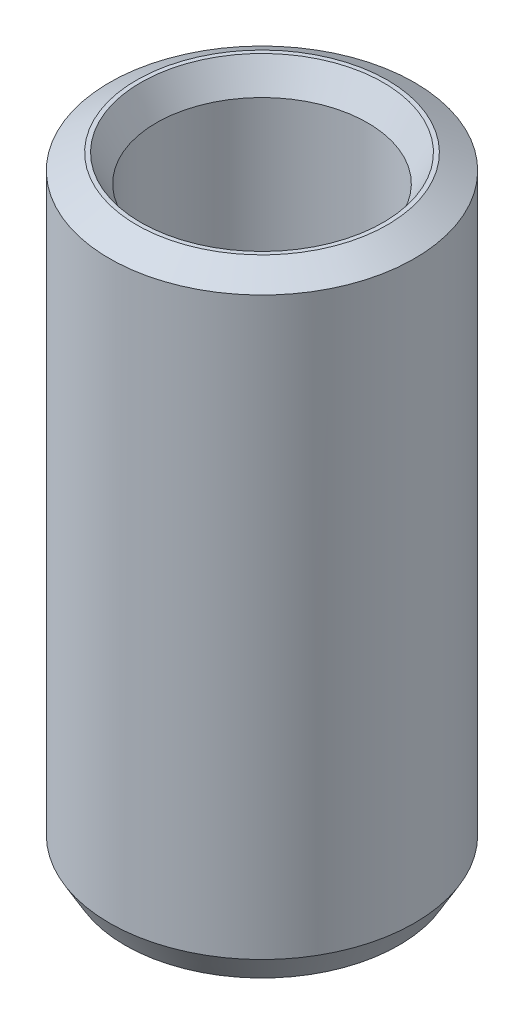
ISO-10303-21;
HEADER;
FILE_DESCRIPTION(('STEP AP214'),'2;1');
FILE_NAME('part.step','',(''),(''),'','','');
FILE_SCHEMA(('AUTOMOTIVE_DESIGN { 1 0 10303 214 1 1 1 1 }'));
ENDSEC;
DATA;
#1=APPLICATION_CONTEXT('core data for automotive mechanical design processes');
#2=APPLICATION_PROTOCOL_DEFINITION('international standard','automotive_design',2000,#1);
#3=PRODUCT_CONTEXT('',#1,'mechanical');
#4=PRODUCT('Part','Part','',(#3));
#5=PRODUCT_RELATED_PRODUCT_CATEGORY('part','',(#4));
#6=PRODUCT_DEFINITION_FORMATION('','',#4);
#7=PRODUCT_DEFINITION_CONTEXT('part definition',#1,'design');
#8=PRODUCT_DEFINITION('design','',#6,#7);
#9=PRODUCT_DEFINITION_SHAPE('','',#8);
#10=(LENGTH_UNIT() NAMED_UNIT(*) SI_UNIT(.MILLI.,.METRE.));
#11=(NAMED_UNIT(*) PLANE_ANGLE_UNIT() SI_UNIT($,.RADIAN.));
#12=(NAMED_UNIT(*) SI_UNIT($,.STERADIAN.) SOLID_ANGLE_UNIT());
#13=UNCERTAINTY_MEASURE_WITH_UNIT(LENGTH_MEASURE(1.E-05),#10,'distance_accuracy_value','');
#14=(GEOMETRIC_REPRESENTATION_CONTEXT(3) GLOBAL_UNCERTAINTY_ASSIGNED_CONTEXT((#13)) GLOBAL_UNIT_ASSIGNED_CONTEXT((#10,
#11,#12)) REPRESENTATION_CONTEXT('',''));
#15=CARTESIAN_POINT('',(0.,0.,0.));
#16=DIRECTION('',(0.,0.,1.));
#17=DIRECTION('',(1.,0.,0.));
#18=AXIS2_PLACEMENT_3D('',#15,#16,#17);
#19=CARTESIAN_POINT('',(0.,121.594950692081,0.));
#20=DIRECTION('',(0.,-1.,0.));
#21=DIRECTION('',(0.,0.,-1.));
#22=AXIS2_PLACEMENT_3D('',#19,#20,#21);
#23=CYLINDRICAL_SURFACE('',#22,30.);
#24=CARTESIAN_POINT('',(0.,5.32596100182925,0.));
#25=DIRECTION('',(0.,1.,0.));
#26=DIRECTION('',(0.,0.,1.));
#27=AXIS2_PLACEMENT_3D('',#24,#25,#26);
#28=CIRCLE('',#27,30.);
#29=CARTESIAN_POINT('',(0.,5.32596100182925,30.));
#30=VERTEX_POINT('',#29);
#31=EDGE_CURVE('E10',#30,#30,#28,.T.);
#32=ORIENTED_EDGE('',*,*,#31,.T.);
#33=EDGE_LOOP('',(#32));
#34=FACE_BOUND('',#33,.T.);
#35=CARTESIAN_POINT('',(0.,118.520005673981,0.));
#36=DIRECTION('',(0.,1.,0.));
#37=DIRECTION('',(0.,0.,1.));
#38=AXIS2_PLACEMENT_3D('',#35,#36,#37);
#39=CIRCLE('',#38,30.);
#40=CARTESIAN_POINT('',(0.,118.520005673981,-30.));
#41=VERTEX_POINT('',#40);
#42=EDGE_CURVE('E50',#41,#41,#39,.F.);
#43=ORIENTED_EDGE('',*,*,#42,.T.);
#44=EDGE_LOOP('',(#43));
#45=FACE_BOUND('',#44,.T.);
#46=ADVANCED_FACE('F39',(#34,#45),#23,.T.);
#47=CARTESIAN_POINT('',(0.,121.594950692081,0.));
#48=DIRECTION('',(0.,1.,0.));
#49=DIRECTION('',(0.,0.,1.));
#50=AXIS2_PLACEMENT_3D('',#47,#48,#49);
#51=PLANE('',#50);
#52=CARTESIAN_POINT('',(0.,121.594950692081,0.));
#53=DIRECTION('',(0.,1.,0.));
#54=DIRECTION('',(0.,0.,1.));
#55=AXIS2_PLACEMENT_3D('',#52,#53,#54);
#56=CIRCLE('',#55,23.8506607987807);
#57=CARTESIAN_POINT('',(0.,121.594950692081,23.8506607987807));
#58=VERTEX_POINT('',#57);
#59=EDGE_CURVE('E58',#58,#58,#56,.F.);
#60=ORIENTED_EDGE('',*,*,#59,.T.);
#61=EDGE_LOOP('',(#60));
#62=FACE_BOUND('',#61,.T.);
#63=CARTESIAN_POINT('',(0.,121.594950692081,0.));
#64=DIRECTION('',(0.,1.,0.));
#65=DIRECTION('',(0.,0.,1.));
#66=AXIS2_PLACEMENT_3D('',#63,#64,#65);
#67=CIRCLE('',#66,24.6740389981708);
#68=CARTESIAN_POINT('',(0.,121.594950692081,-24.6740389981708));
#69=VERTEX_POINT('',#68);
#70=EDGE_CURVE('E61',#69,#69,#67,.T.);
#71=ORIENTED_EDGE('',*,*,#70,.T.);
#72=EDGE_LOOP('',(#71));
#73=FACE_BOUND('',#72,.T.);
#74=ADVANCED_FACE('F88',(#62,#73),#51,.T.);
#75=CARTESIAN_POINT('',(0.,0.,0.));
#76=DIRECTION('',(0.,1.,0.));
#77=DIRECTION('',(0.,0.,1.));
#78=AXIS2_PLACEMENT_3D('',#75,#76,#77);
#79=PLANE('',#78);
#80=CARTESIAN_POINT('',(0.,0.,0.));
#81=DIRECTION('',(0.,1.,0.));
#82=DIRECTION('',(0.,0.,1.));
#83=AXIS2_PLACEMENT_3D('',#80,#81,#82);
#84=CIRCLE('',#83,26.1016767825104);
#85=CARTESIAN_POINT('',(0.,0.,26.1016767825104));
#86=VERTEX_POINT('',#85);
#87=EDGE_CURVE('E51',#86,#86,#84,.T.);
#88=ORIENTED_EDGE('',*,*,#87,.T.);
#89=EDGE_LOOP('',(#88));
#90=FACE_BOUND('',#89,.T.);
#91=CARTESIAN_POINT('',(0.,0.,0.));
#92=DIRECTION('',(0.,1.,0.));
#93=DIRECTION('',(0.,0.,1.));
#94=AXIS2_PLACEMENT_3D('',#91,#92,#93);
#95=CIRCLE('',#94,26.9250549819004);
#96=CARTESIAN_POINT('',(0.,0.,26.9250549819004));
#97=VERTEX_POINT('',#96);
#98=EDGE_CURVE('E54',#97,#97,#95,.F.);
#99=ORIENTED_EDGE('',*,*,#98,.T.);
#100=EDGE_LOOP('',(#99));
#101=FACE_BOUND('',#100,.T.);
#102=ADVANCED_FACE('F83',(#90,#101),#79,.F.);
#103=CARTESIAN_POINT('',(0.,121.594950692081,0.));
#104=DIRECTION('',(0.,-1.,0.));
#105=DIRECTION('',(0.,0.,-1.));
#106=AXIS2_PLACEMENT_3D('',#103,#104,#105);
#107=CYLINDRICAL_SURFACE('',#106,20.7757157806811);
#108=CARTESIAN_POINT('',(0.,116.268989690252,0.));
#109=DIRECTION('',(0.,1.,0.));
#110=DIRECTION('',(0.,0.,1.));
#111=AXIS2_PLACEMENT_3D('',#108,#109,#110);
#112=CIRCLE('',#111,20.7757157806811);
#113=CARTESIAN_POINT('',(0.,116.268989690252,20.7757157806811));
#114=VERTEX_POINT('',#113);
#115=EDGE_CURVE('E67',#114,#114,#112,.T.);
#116=ORIENTED_EDGE('',*,*,#115,.T.);
#117=EDGE_LOOP('',(#116));
#118=FACE_BOUND('',#117,.T.);
#119=CARTESIAN_POINT('',(0.,3.07494501809959,0.));
#120=DIRECTION('',(0.,1.,0.));
#121=DIRECTION('',(0.,0.,1.));
#122=AXIS2_PLACEMENT_3D('',#119,#120,#121);
#123=CIRCLE('',#122,20.7757157806811);
#124=CARTESIAN_POINT('',(0.,3.07494501809959,20.7757157806811));
#125=VERTEX_POINT('',#124);
#126=EDGE_CURVE('E69',#125,#125,#123,.F.);
#127=ORIENTED_EDGE('',*,*,#126,.T.);
#128=EDGE_LOOP('',(#127));
#129=FACE_BOUND('',#128,.T.);
#130=ADVANCED_FACE('F71',(#118,#129),#107,.F.);
#131=CARTESIAN_POINT('',(0.,116.268989690252,0.));
#132=DIRECTION('',(0.,1.,0.));
#133=DIRECTION('',(0.,0.,1.));
#134=AXIS2_PLACEMENT_3D('',#131,#132,#133);
#135=CONICAL_SURFACE('',#134,20.7757157806811,0.523598775598303);
#136=ORIENTED_EDGE('',*,*,#59,.F.);
#137=EDGE_LOOP('',(#136));
#138=FACE_BOUND('',#137,.T.);
#139=ORIENTED_EDGE('',*,*,#115,.F.);
#140=EDGE_LOOP('',(#139));
#141=FACE_BOUND('',#140,.T.);
#142=ADVANCED_FACE('F77',(#138,#141),#135,.F.);
#143=CARTESIAN_POINT('',(0.,0.,0.));
#144=DIRECTION('',(0.,-1.,0.));
#145=DIRECTION('',(0.,0.,-1.));
#146=AXIS2_PLACEMENT_3D('',#143,#144,#145);
#147=CONICAL_SURFACE('',#146,26.1016767825104,1.0471975511966);
#148=ORIENTED_EDGE('',*,*,#126,.F.);
#149=EDGE_LOOP('',(#148));
#150=FACE_BOUND('',#149,.T.);
#151=ORIENTED_EDGE('',*,*,#87,.F.);
#152=EDGE_LOOP('',(#151));
#153=FACE_BOUND('',#152,.T.);
#154=ADVANCED_FACE('F73',(#150,#153),#147,.F.);
#155=CARTESIAN_POINT('',(0.,5.32596100182925,0.));
#156=DIRECTION('',(0.,1.,0.));
#157=DIRECTION('',(0.,0.,1.));
#158=AXIS2_PLACEMENT_3D('',#155,#156,#157);
#159=CONICAL_SURFACE('',#158,30.,0.523598775598303);
#160=ORIENTED_EDGE('',*,*,#98,.F.);
#161=EDGE_LOOP('',(#160));
#162=FACE_BOUND('',#161,.T.);
#163=ORIENTED_EDGE('',*,*,#31,.F.);
#164=EDGE_LOOP('',(#163));
#165=FACE_BOUND('',#164,.T.);
#166=ADVANCED_FACE('F76',(#162,#165),#159,.T.);
#167=CARTESIAN_POINT('',(0.,121.594950692081,0.));
#168=DIRECTION('',(0.,-1.,0.));
#169=DIRECTION('',(0.,0.,-1.));
#170=AXIS2_PLACEMENT_3D('',#167,#168,#169);
#171=CONICAL_SURFACE('',#170,24.6740389981708,1.0471975511966);
#172=CARTESIAN_POINT('',(0.,118.520005673981,-30.));
#173=CARTESIAN_POINT('',(0.,118.552036351253,-29.9445212395643));
#174=CARTESIAN_POINT('',(0.,118.584067028525,-29.8890424791286));
#175=CARTESIAN_POINT('',(0.,118.648128383069,-29.7780849582571));
#176=CARTESIAN_POINT('',(0.,118.680159060341,-29.7226061978214));
#177=CARTESIAN_POINT('',(0.,118.744220414884,-29.61164867695));
#178=CARTESIAN_POINT('',(0.,118.776251092156,-29.5561699165142));
#179=CARTESIAN_POINT('',(0.,118.8403124467,-29.4452123956428));
#180=CARTESIAN_POINT('',(0.,118.872343123972,-29.3897336352071));
#181=CARTESIAN_POINT('',(0.,118.936404478516,-29.2787761143356));
#182=CARTESIAN_POINT('',(0.,118.968435155788,-29.2232973538999));
#183=CARTESIAN_POINT('',(0.,119.032496510331,-29.1123398330285));
#184=CARTESIAN_POINT('',(0.,119.064527187603,-29.0568610725928));
#185=CARTESIAN_POINT('',(0.,119.128588542147,-28.9459035517213));
#186=CARTESIAN_POINT('',(0.,119.160619219419,-28.8904247912856));
#187=CARTESIAN_POINT('',(0.,119.224680573962,-28.7794672704141));
#188=CARTESIAN_POINT('',(0.,119.256711251234,-28.7239885099784));
#189=CARTESIAN_POINT('',(0.,119.320772605778,-28.613030989107));
#190=CARTESIAN_POINT('',(0.,119.35280328305,-28.5575522286713));
#191=CARTESIAN_POINT('',(0.,119.416864637594,-28.4465947077998));
#192=CARTESIAN_POINT('',(0.,119.448895314866,-28.3911159473641));
#193=CARTESIAN_POINT('',(0.,119.512956669409,-28.2801584264927));
#194=CARTESIAN_POINT('',(0.,119.544987346681,-28.2246796660569));
#195=CARTESIAN_POINT('',(0.,119.609048701225,-28.1137221451855));
#196=CARTESIAN_POINT('',(0.,119.641079378497,-28.0582433847498));
#197=CARTESIAN_POINT('',(0.,119.705140733041,-27.9472858638783));
#198=CARTESIAN_POINT('',(0.,119.737171410312,-27.8918071034426));
#199=CARTESIAN_POINT('',(0.,119.801232764856,-27.7808495825712));
#200=CARTESIAN_POINT('',(0.,119.833263442128,-27.7253708221354));
#201=CARTESIAN_POINT('',(0.,119.897324796672,-27.614413301264));
#202=CARTESIAN_POINT('',(0.,119.929355473944,-27.5589345408283));
#203=CARTESIAN_POINT('',(0.,119.993416828487,-27.4479770199568));
#204=CARTESIAN_POINT('',(0.,120.025447505759,-27.3924982595211));
#205=CARTESIAN_POINT('',(0.,120.089508860303,-27.2815407386497));
#206=CARTESIAN_POINT('',(0.,120.121539537575,-27.226061978214));
#207=CARTESIAN_POINT('',(0.,120.185600892119,-27.1151044573425));
#208=CARTESIAN_POINT('',(0.,120.21763156939,-27.0596256969068));
#209=CARTESIAN_POINT('',(0.,120.281692923934,-26.9486681760354));
#210=CARTESIAN_POINT('',(0.,120.313723601206,-26.8931894155996));
#211=CARTESIAN_POINT('',(0.,120.37778495575,-26.7822318947282));
#212=CARTESIAN_POINT('',(0.,120.409815633022,-26.7267531342925));
#213=CARTESIAN_POINT('',(0.,120.473876987565,-26.615795613421));
#214=CARTESIAN_POINT('',(0.,120.505907664837,-26.5603168529853));
#215=CARTESIAN_POINT('',(0.,120.569969019381,-26.4493593321139));
#216=CARTESIAN_POINT('',(0.,120.601999696653,-26.3938805716781));
#217=CARTESIAN_POINT('',(0.,120.666061051197,-26.2829230508067));
#218=CARTESIAN_POINT('',(0.,120.698091728469,-26.227444290371));
#219=CARTESIAN_POINT('',(0.,120.762153083012,-26.1164867694995));
#220=CARTESIAN_POINT('',(0.,120.794183760284,-26.0610080090638));
#221=CARTESIAN_POINT('',(0.,120.858245114828,-25.9500504881924));
#222=CARTESIAN_POINT('',(0.,120.8902757921,-25.8945717277567));
#223=CARTESIAN_POINT('',(0.,120.954337146643,-25.7836142068852));
#224=CARTESIAN_POINT('',(0.,120.986367823915,-25.7281354464495));
#225=CARTESIAN_POINT('',(0.,121.050429178459,-25.617177925578));
#226=CARTESIAN_POINT('',(0.,121.082459855731,-25.5616991651423));
#227=CARTESIAN_POINT('',(0.,121.146521210275,-25.4507416442709));
#228=CARTESIAN_POINT('',(0.,121.178551887547,-25.3952628838352));
#229=CARTESIAN_POINT('',(0.,121.24261324209,-25.2843053629637));
#230=CARTESIAN_POINT('',(0.,121.274643919362,-25.228826602528));
#231=CARTESIAN_POINT('',(0.,121.338705273906,-25.1178690816566));
#232=CARTESIAN_POINT('',(0.,121.370735951178,-25.0623903212208));
#233=CARTESIAN_POINT('',(0.,121.434797305722,-24.9514328003494));
#234=CARTESIAN_POINT('',(0.,121.466827982993,-24.8959540399137));
#235=CARTESIAN_POINT('',(0.,121.530889337537,-24.7849965190422));
#236=CARTESIAN_POINT('',(0.,121.562920014809,-24.7295177586065));
#237=CARTESIAN_POINT('',(0.,121.594950692081,-24.6740389981708));
#238=B_SPLINE_CURVE_WITH_KNOTS('',3,(#172,#173,#174,#175,#176,#177,#178,#179,#180,#181,#182,
#183,#184,#185,#186,#187,#188,#189,#190,#191,#192,#193,#194,#195,#196,#197,#198,#199,#200,#201,
#202,#203,#204,#205,#206,#207,#208,#209,#210,#211,#212,#213,#214,#215,#216,#217,#218,#219,#220,
#221,#222,#223,#224,#225,#226,#227,#228,#229,#230,#231,#232,#233,#234,#235,#236,#237),
.UNSPECIFIED.,.F.,.F.,(4,2,2,2,2,2,2,2,2,2,2,2,2,2,2,2,2,2,2,2,2,2,2,2,2,2,2,2,2,2,2,2,4),(0.,
0.192184063631223,0.384368127262446,0.576552190893669,0.768736254524889,0.960920318156112,
1.15310438178733,1.34528844541855,1.53747250904978,1.729656572681,1.92184063631222,
2.11402469994345,2.30620876357467,2.49839282720589,2.69057689083711,2.88276095446833,
3.07494501809955,3.26712908173077,3.45931314536199,3.65149720899322,3.84368127262444,
4.03586533625566,4.22804939988689,4.42023346351811,4.61241752714933,4.80460159078055,
4.99678565441178,5.188969718043,5.38115378167422,5.57333784530544,5.76552190893667,
5.95770597256789,6.14989003619911),.UNSPECIFIED.);
#239=EDGE_CURVE('BSEAM45',#41,#69,#238,.T.);
#240=ORIENTED_EDGE('',*,*,#42,.F.);
#241=ORIENTED_EDGE('',*,*,#70,.F.);
#242=ORIENTED_EDGE('',*,*,#239,.T.);
#243=ORIENTED_EDGE('',*,*,#239,.F.);
#244=EDGE_LOOP('',(#240,#242,#241,#243));
#245=FACE_BOUND('',#244,.T.);
#246=ADVANCED_FACE('F45',(#245),#171,.T.);
#247=CLOSED_SHELL('',(#46,#74,#102,#130,#142,#154,#166,#246));
#248=MANIFOLD_SOLID_BREP('B2',#247);
#249=ADVANCED_BREP_SHAPE_REPRESENTATION('',(#18,#248),#14);
#250=SHAPE_DEFINITION_REPRESENTATION(#9,#249);
ENDSEC;
END-ISO-10303-21;
